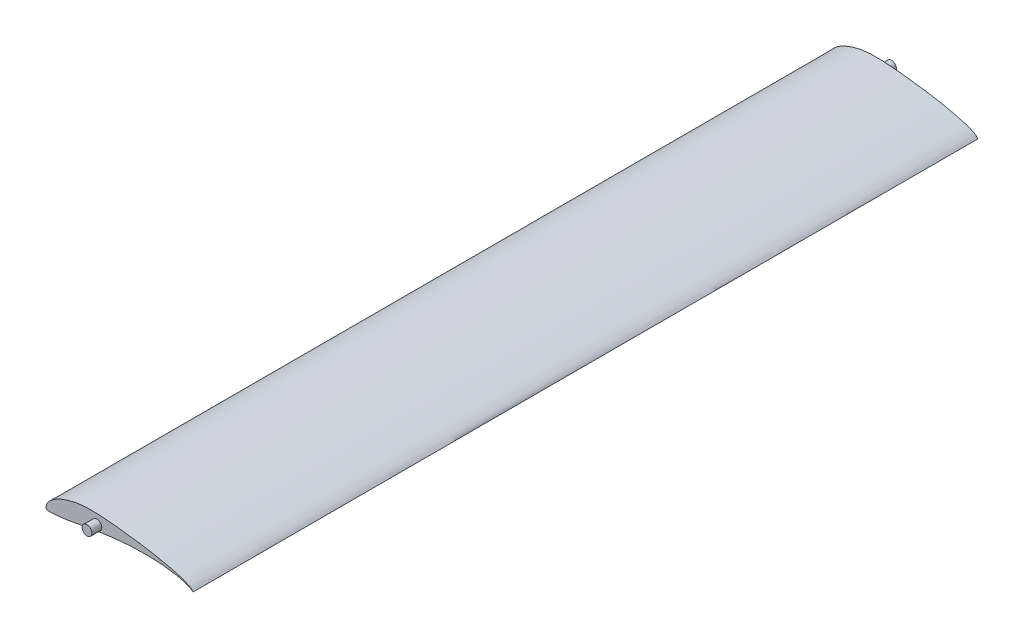
ISO-10303-21;
HEADER;
FILE_DESCRIPTION(('STEP AP214'),'2;1');
FILE_NAME('part.step','',(''),(''),'','','');
FILE_SCHEMA(('AUTOMOTIVE_DESIGN { 1 0 10303 214 1 1 1 1 }'));
ENDSEC;
DATA;
#1=APPLICATION_CONTEXT('core data for automotive mechanical design processes');
#2=APPLICATION_PROTOCOL_DEFINITION('international standard','automotive_design',2000,#1);
#3=PRODUCT_CONTEXT('',#1,'mechanical');
#4=PRODUCT('Part','Part','',(#3));
#5=PRODUCT_RELATED_PRODUCT_CATEGORY('part','',(#4));
#6=PRODUCT_DEFINITION_FORMATION('','',#4);
#7=PRODUCT_DEFINITION_CONTEXT('part definition',#1,'design');
#8=PRODUCT_DEFINITION('design','',#6,#7);
#9=PRODUCT_DEFINITION_SHAPE('','',#8);
#10=(LENGTH_UNIT() NAMED_UNIT(*) SI_UNIT(.MILLI.,.METRE.));
#11=(NAMED_UNIT(*) PLANE_ANGLE_UNIT() SI_UNIT($,.RADIAN.));
#12=(NAMED_UNIT(*) SI_UNIT($,.STERADIAN.) SOLID_ANGLE_UNIT());
#13=UNCERTAINTY_MEASURE_WITH_UNIT(LENGTH_MEASURE(1.E-05),#10,'distance_accuracy_value','');
#14=(GEOMETRIC_REPRESENTATION_CONTEXT(3) GLOBAL_UNCERTAINTY_ASSIGNED_CONTEXT((#13)) GLOBAL_UNIT_ASSIGNED_CONTEXT((#10,
#11,#12)) REPRESENTATION_CONTEXT('',''));
#15=CARTESIAN_POINT('',(0.,0.,0.));
#16=DIRECTION('',(0.,0.,1.));
#17=DIRECTION('',(1.,0.,0.));
#18=AXIS2_PLACEMENT_3D('',#15,#16,#17);
#19=CARTESIAN_POINT('',(75.,0.,200.));
#20=CARTESIAN_POINT('',(75.0004496445761,0.00190909825375727,200.));
#21=CARTESIAN_POINT('',(74.7539650846418,0.18568888920372,200.));
#22=CARTESIAN_POINT('',(74.5455245103844,0.390346100222199,200.));
#23=CARTESIAN_POINT('',(74.0826929591282,0.81782244358845,200.));
#24=CARTESIAN_POINT('',(73.5366428814038,1.272594015395,200.));
#25=CARTESIAN_POINT('',(72.7896369649627,1.73112202127673,200.));
#26=CARTESIAN_POINT('',(71.8606861369259,2.1755580807662,200.));
#27=CARTESIAN_POINT('',(70.7391988465833,2.6394332773395,200.));
#28=CARTESIAN_POINT('',(69.426882591104,3.1162933669167,200.));
#29=CARTESIAN_POINT('',(67.9298593241598,3.60277077102481,200.));
#30=CARTESIAN_POINT('',(66.2559000317893,4.09464350577679,200.));
#31=CARTESIAN_POINT('',(64.4143785726742,4.58960243450024,200.));
#32=CARTESIAN_POINT('',(62.4154624095736,5.08310520978531,200.));
#33=CARTESIAN_POINT('',(60.27061159506,5.5715804249983,200.));
#34=CARTESIAN_POINT('',(57.9926099207445,6.05197727824083,200.));
#35=CARTESIAN_POINT('',(55.5953680809258,6.52182540512935,200.));
#36=CARTESIAN_POINT('',(53.0928958344792,6.97534838004791,200.));
#37=CARTESIAN_POINT('',(50.500952478377,7.41189405377128,200.));
#38=CARTESIAN_POINT('',(47.8344745216971,7.82584741006352,200.));
#39=CARTESIAN_POINT('',(45.1107073437426,8.21800904383186,200.));
#40=CARTESIAN_POINT('',(42.3471068366815,8.58527269117428,200.));
#41=CARTESIAN_POINT('',(39.5636902816788,8.92645928148939,200.));
#42=CARTESIAN_POINT('',(36.7827107486502,9.24397015410012,200.));
#43=CARTESIAN_POINT('',(34.0271887584163,9.52980992301489,200.));
#44=CARTESIAN_POINT('',(31.3195720900264,9.7786387993947,200.));
#45=CARTESIAN_POINT('',(28.6788997026202,9.9764972494583,200.));
#46=CARTESIAN_POINT('',(26.1202528498229,10.1128540004117,200.));
#47=CARTESIAN_POINT('',(23.6578610442693,10.1722065518051,200.));
#48=CARTESIAN_POINT('',(21.3043430859275,10.1667893876018,200.));
#49=CARTESIAN_POINT('',(19.0640739487674,10.0523256556296,200.));
#50=CARTESIAN_POINT('',(16.9361826355282,9.81953966700003,200.));
#51=CARTESIAN_POINT('',(14.912014741791,9.4900378061296,200.));
#52=CARTESIAN_POINT('',(12.9910814536495,9.06292958510876,200.));
#53=CARTESIAN_POINT('',(11.1753642654142,8.56193521707815,200.));
#54=CARTESIAN_POINT('',(9.47254802893839,7.99593650555071,200.));
#55=CARTESIAN_POINT('',(7.889878396715,7.37818056585829,200.));
#56=CARTESIAN_POINT('',(6.43719008088212,6.71197664075074,200.));
#57=CARTESIAN_POINT('',(5.11914570801355,6.01085913549423,200.));
#58=CARTESIAN_POINT('',(3.94291730529894,5.2828038016739,200.));
#59=CARTESIAN_POINT('',(2.91588294840669,4.53767936791485,200.));
#60=CARTESIAN_POINT('',(2.03847172502033,3.79128699549852,200.));
#61=CARTESIAN_POINT('',(1.32340110520667,3.03547157484839,200.));
#62=CARTESIAN_POINT('',(0.774074332682458,2.27677944405746,200.));
#63=CARTESIAN_POINT('',(0.368239292992317,1.53862876914142,200.));
#64=CARTESIAN_POINT('',(0.108063550642199,0.837746589697899,200.));
#65=CARTESIAN_POINT('',(-0.016017959621266,0.190792591828808,200.));
#66=CARTESIAN_POINT('',(0.00770173626844277,-0.356421442258013,200.));
#67=CARTESIAN_POINT('',(0.148409214072156,-0.85834584120313,200.));
#68=CARTESIAN_POINT('',(0.671997952917858,-1.10766100715331,200.));
#69=CARTESIAN_POINT('',(1.37607317791627,-1.14285625358404,200.));
#70=CARTESIAN_POINT('',(2.33925025972924,-1.17706429553805,200.));
#71=CARTESIAN_POINT('',(3.55054606737345,-1.12524848041678,200.));
#72=CARTESIAN_POINT('',(4.99625618674844,-1.0297581612487,200.));
#73=CARTESIAN_POINT('',(6.6602965641612,-0.876579013304086,200.));
#74=CARTESIAN_POINT('',(8.52563879771387,-0.669188084411804,200.));
#75=CARTESIAN_POINT('',(10.583188874696,-0.403118227638063,200.));
#76=CARTESIAN_POINT('',(12.8319576438414,-0.03103015696071,200.));
#77=CARTESIAN_POINT('',(15.2828896232802,0.435689290153553,200.));
#78=CARTESIAN_POINT('',(17.9482186312497,0.943629694509403,200.));
#79=CARTESIAN_POINT('',(20.8149131818034,1.47992386846413,200.));
#80=CARTESIAN_POINT('',(23.8649609021435,2.02227718826716,200.));
#81=CARTESIAN_POINT('',(27.0759564854619,2.55030407495741,200.));
#82=CARTESIAN_POINT('',(30.4229841349676,3.0463439914876,200.));
#83=CARTESIAN_POINT('',(33.8771945164878,3.49216806993824,200.));
#84=CARTESIAN_POINT('',(37.4075217860949,3.87477105665107,200.));
#85=CARTESIAN_POINT('',(40.9806127438822,4.17693355434812,200.));
#86=CARTESIAN_POINT('',(44.5606088702483,4.39076899802771,200.));
#87=CARTESIAN_POINT('',(48.1101062396026,4.50778173767263,200.));
#88=CARTESIAN_POINT('',(51.5905972490682,4.52151734814729,200.));
#89=CARTESIAN_POINT('',(54.9632512783806,4.43097450951274,200.));
#90=CARTESIAN_POINT('',(58.1894498089462,4.23825896008471,200.));
#91=CARTESIAN_POINT('',(61.2303983181482,3.94585627434351,200.));
#92=CARTESIAN_POINT('',(64.0498951493785,3.5649625727911,200.));
#93=CARTESIAN_POINT('',(66.6112334491586,3.10661442607939,200.));
#94=CARTESIAN_POINT('',(68.8843860883419,2.58614328579619,200.));
#95=CARTESIAN_POINT('',(70.8274655002964,2.02938443707066,200.));
#96=CARTESIAN_POINT('',(72.4176279592342,1.43532984662795,200.));
#97=CARTESIAN_POINT('',(73.552126735224,0.891804256587506,200.));
#98=CARTESIAN_POINT('',(74.3885273611334,0.389315433269344,200.));
#99=CARTESIAN_POINT('',(74.7098360264349,0.194861362006685,200.));
#100=CARTESIAN_POINT('',(74.9995412141903,-0.00194791004865642,200.));
#101=CARTESIAN_POINT('',(75.,0.,200.));
#102=B_SPLINE_CURVE_WITH_KNOTS('',3,(#19,#20,#21,#22,#23,#24,#25,#26,#27,#28,#29,#30,#31,#32,
#33,#34,#35,#36,#37,#38,#39,#40,#41,#42,#43,#44,#45,#46,#47,#48,#49,#50,#51,#52,#53,#54,#55,#56,
#57,#58,#59,#60,#61,#62,#63,#64,#65,#66,#67,#68,#69,#70,#71,#72,#73,#74,#75,#76,#77,#78,#79,#80,
#81,#82,#83,#84,#85,#86,#87,#88,#89,#90,#91,#92,#93,#94,#95,#96,#97,#98,#99,#100,#101),
.UNSPECIFIED.,.T.,.F.,(4,1,1,1,1,1,1,1,1,1,1,1,1,1,1,1,1,1,1,1,1,1,1,1,1,1,1,1,1,1,1,1,1,1,1,1,
1,1,1,1,1,1,1,1,1,1,1,1,1,1,1,1,1,1,1,1,1,1,1,1,1,1,1,1,1,1,1,1,1,1,1,1,1,1,1,1,1,1,1,1,4),(0.,
0.000979677557134219,0.00364886216776309,0.00748349851947813,0.0120952771855934,
0.0175255907768788,0.0240517799938711,0.0317830505527587,0.0406778280832619,0.050710300790478,
0.0618332290621795,0.0739892504845854,0.0871181731906813,0.101145048769791,0.115990637111827,
0.131570421640589,0.147788379302961,0.164550916882416,0.181757895150531,0.199311954944345,
0.217095071712265,0.234990228463986,0.252856883122009,0.270540593729572,0.287886779266045,
0.304773437599674,0.321101419214061,0.336806063174811,0.351800032584037,0.366031063392082,
0.379615674919835,0.392652962879186,0.405170358707495,0.417171919049936,0.428603516911185,
0.43941895910826,0.449596586064162,0.459102079103161,0.467907877534646,0.475988300736527,
0.48330896874615,0.489874507816402,0.495803249719208,0.501149411695553,0.505903073256041,
0.510046768536663,0.513579310681042,0.516446926626751,0.519350052590901,0.523823355179486,
0.529973793997694,0.537715654387928,0.546967844488147,0.557637366825711,0.569620481096633,
0.582804124215616,0.597246960791633,0.613135036654701,0.630443600329816,0.649056123608546,
0.668822256795696,0.689594964002685,0.711189650864602,0.733426688964389,0.756094117504156,
0.778988553684861,0.801889682684955,0.824566597829707,0.846792284880412,0.868338290507787,
0.888978162959066,0.908492011340558,0.926658767581933,0.943286193042322,0.958169210358795,
0.971135821634751,0.981955623079976,0.990251791025976,0.995852565249962,0.999000405686701,1.),.UNSPECIFIED.);
#103=DIRECTION('',(0.,0.,-1.));
#104=VECTOR('',#103,1.);
#105=SURFACE_OF_LINEAR_EXTRUSION('',#102,#104);
#106=CARTESIAN_POINT('',(75.,0.,200.));
#107=VERTEX_POINT('',#106);
#108=EDGE_CURVE('E51',#107,#107,#102,.T.);
#109=ORIENTED_EDGE('',*,*,#108,.F.);
#110=EDGE_LOOP('',(#109));
#111=FACE_BOUND('',#110,.T.);
#112=CARTESIAN_POINT('',(75.,0.,-200.));
#113=CARTESIAN_POINT('',(75.0004496445761,0.00190909825375727,-200.));
#114=CARTESIAN_POINT('',(74.7539650846418,0.18568888920372,-200.));
#115=CARTESIAN_POINT('',(74.5455245103844,0.390346100222199,-200.));
#116=CARTESIAN_POINT('',(74.0826929591282,0.81782244358845,-200.));
#117=CARTESIAN_POINT('',(73.5366428814038,1.272594015395,-200.));
#118=CARTESIAN_POINT('',(72.7896369649627,1.73112202127673,-200.));
#119=CARTESIAN_POINT('',(71.8606861369259,2.1755580807662,-200.));
#120=CARTESIAN_POINT('',(70.7391988465833,2.6394332773395,-200.));
#121=CARTESIAN_POINT('',(69.426882591104,3.1162933669167,-200.));
#122=CARTESIAN_POINT('',(67.9298593241598,3.60277077102481,-200.));
#123=CARTESIAN_POINT('',(66.2559000317893,4.09464350577679,-200.));
#124=CARTESIAN_POINT('',(64.4143785726742,4.58960243450024,-200.));
#125=CARTESIAN_POINT('',(62.4154624095736,5.08310520978531,-200.));
#126=CARTESIAN_POINT('',(60.27061159506,5.5715804249983,-200.));
#127=CARTESIAN_POINT('',(57.9926099207445,6.05197727824083,-200.));
#128=CARTESIAN_POINT('',(55.5953680809258,6.52182540512935,-200.));
#129=CARTESIAN_POINT('',(53.0928958344792,6.97534838004791,-200.));
#130=CARTESIAN_POINT('',(50.500952478377,7.41189405377128,-200.));
#131=CARTESIAN_POINT('',(47.8344745216971,7.82584741006352,-200.));
#132=CARTESIAN_POINT('',(45.1107073437426,8.21800904383186,-200.));
#133=CARTESIAN_POINT('',(42.3471068366815,8.58527269117428,-200.));
#134=CARTESIAN_POINT('',(39.5636902816788,8.92645928148939,-200.));
#135=CARTESIAN_POINT('',(36.7827107486502,9.24397015410012,-200.));
#136=CARTESIAN_POINT('',(34.0271887584163,9.52980992301489,-200.));
#137=CARTESIAN_POINT('',(31.3195720900264,9.7786387993947,-200.));
#138=CARTESIAN_POINT('',(28.6788997026202,9.9764972494583,-200.));
#139=CARTESIAN_POINT('',(26.1202528498229,10.1128540004117,-200.));
#140=CARTESIAN_POINT('',(23.6578610442693,10.1722065518051,-200.));
#141=CARTESIAN_POINT('',(21.3043430859275,10.1667893876018,-200.));
#142=CARTESIAN_POINT('',(19.0640739487674,10.0523256556296,-200.));
#143=CARTESIAN_POINT('',(16.9361826355282,9.81953966700003,-200.));
#144=CARTESIAN_POINT('',(14.912014741791,9.4900378061296,-200.));
#145=CARTESIAN_POINT('',(12.9910814536495,9.06292958510876,-200.));
#146=CARTESIAN_POINT('',(11.1753642654142,8.56193521707815,-200.));
#147=CARTESIAN_POINT('',(9.47254802893839,7.99593650555071,-200.));
#148=CARTESIAN_POINT('',(7.889878396715,7.37818056585829,-200.));
#149=CARTESIAN_POINT('',(6.43719008088212,6.71197664075074,-200.));
#150=CARTESIAN_POINT('',(5.11914570801355,6.01085913549423,-200.));
#151=CARTESIAN_POINT('',(3.94291730529894,5.2828038016739,-200.));
#152=CARTESIAN_POINT('',(2.91588294840669,4.53767936791485,-200.));
#153=CARTESIAN_POINT('',(2.03847172502033,3.79128699549852,-200.));
#154=CARTESIAN_POINT('',(1.32340110520667,3.03547157484839,-200.));
#155=CARTESIAN_POINT('',(0.774074332682458,2.27677944405746,-200.));
#156=CARTESIAN_POINT('',(0.368239292992317,1.53862876914142,-200.));
#157=CARTESIAN_POINT('',(0.108063550642199,0.837746589697899,-200.));
#158=CARTESIAN_POINT('',(-0.016017959621266,0.190792591828808,-200.));
#159=CARTESIAN_POINT('',(0.00770173626844277,-0.356421442258013,-200.));
#160=CARTESIAN_POINT('',(0.148409214072156,-0.85834584120313,-200.));
#161=CARTESIAN_POINT('',(0.671997952917858,-1.10766100715331,-200.));
#162=CARTESIAN_POINT('',(1.37607317791627,-1.14285625358404,-200.));
#163=CARTESIAN_POINT('',(2.33925025972924,-1.17706429553805,-200.));
#164=CARTESIAN_POINT('',(3.55054606737345,-1.12524848041678,-200.));
#165=CARTESIAN_POINT('',(4.99625618674844,-1.0297581612487,-200.));
#166=CARTESIAN_POINT('',(6.6602965641612,-0.876579013304086,-200.));
#167=CARTESIAN_POINT('',(8.52563879771387,-0.669188084411804,-200.));
#168=CARTESIAN_POINT('',(10.583188874696,-0.403118227638063,-200.));
#169=CARTESIAN_POINT('',(12.8319576438414,-0.03103015696071,-200.));
#170=CARTESIAN_POINT('',(15.2828896232802,0.435689290153553,-200.));
#171=CARTESIAN_POINT('',(17.9482186312497,0.943629694509403,-200.));
#172=CARTESIAN_POINT('',(20.8149131818034,1.47992386846413,-200.));
#173=CARTESIAN_POINT('',(23.8649609021435,2.02227718826716,-200.));
#174=CARTESIAN_POINT('',(27.0759564854619,2.55030407495741,-200.));
#175=CARTESIAN_POINT('',(30.4229841349676,3.0463439914876,-200.));
#176=CARTESIAN_POINT('',(33.8771945164878,3.49216806993824,-200.));
#177=CARTESIAN_POINT('',(37.4075217860949,3.87477105665107,-200.));
#178=CARTESIAN_POINT('',(40.9806127438822,4.17693355434812,-200.));
#179=CARTESIAN_POINT('',(44.5606088702483,4.39076899802771,-200.));
#180=CARTESIAN_POINT('',(48.1101062396026,4.50778173767263,-200.));
#181=CARTESIAN_POINT('',(51.5905972490682,4.52151734814729,-200.));
#182=CARTESIAN_POINT('',(54.9632512783806,4.43097450951274,-200.));
#183=CARTESIAN_POINT('',(58.1894498089462,4.23825896008471,-200.));
#184=CARTESIAN_POINT('',(61.2303983181482,3.94585627434351,-200.));
#185=CARTESIAN_POINT('',(64.0498951493785,3.5649625727911,-200.));
#186=CARTESIAN_POINT('',(66.6112334491586,3.10661442607939,-200.));
#187=CARTESIAN_POINT('',(68.8843860883419,2.58614328579619,-200.));
#188=CARTESIAN_POINT('',(70.8274655002964,2.02938443707066,-200.));
#189=CARTESIAN_POINT('',(72.4176279592342,1.43532984662795,-200.));
#190=CARTESIAN_POINT('',(73.552126735224,0.891804256587506,-200.));
#191=CARTESIAN_POINT('',(74.3885273611334,0.389315433269344,-200.));
#192=CARTESIAN_POINT('',(74.7098360264349,0.194861362006685,-200.));
#193=CARTESIAN_POINT('',(74.9995412141903,-0.00194791004865642,-200.));
#194=CARTESIAN_POINT('',(75.,0.,-200.));
#195=B_SPLINE_CURVE_WITH_KNOTS('',3,(#112,#113,#114,#115,#116,#117,#118,#119,#120,#121,#122,
#123,#124,#125,#126,#127,#128,#129,#130,#131,#132,#133,#134,#135,#136,#137,#138,#139,#140,#141,
#142,#143,#144,#145,#146,#147,#148,#149,#150,#151,#152,#153,#154,#155,#156,#157,#158,#159,#160,
#161,#162,#163,#164,#165,#166,#167,#168,#169,#170,#171,#172,#173,#174,#175,#176,#177,#178,#179,
#180,#181,#182,#183,#184,#185,#186,#187,#188,#189,#190,#191,#192,#193,#194),.UNSPECIFIED.,.T.,
.F.,(4,1,1,1,1,1,1,1,1,1,1,1,1,1,1,1,1,1,1,1,1,1,1,1,1,1,1,1,1,1,1,1,1,1,1,1,1,1,1,1,1,1,1,1,1,
1,1,1,1,1,1,1,1,1,1,1,1,1,1,1,1,1,1,1,1,1,1,1,1,1,1,1,1,1,1,1,1,1,1,1,4),(0.,
0.000979677557134219,0.00364886216776309,0.00748349851947813,0.0120952771855934,
0.0175255907768788,0.0240517799938711,0.0317830505527587,0.0406778280832619,0.050710300790478,
0.0618332290621795,0.0739892504845854,0.0871181731906813,0.101145048769791,0.115990637111827,
0.131570421640589,0.147788379302961,0.164550916882416,0.181757895150531,0.199311954944345,
0.217095071712265,0.234990228463986,0.252856883122009,0.270540593729572,0.287886779266045,
0.304773437599674,0.321101419214061,0.336806063174811,0.351800032584037,0.366031063392082,
0.379615674919835,0.392652962879186,0.405170358707495,0.417171919049936,0.428603516911185,
0.43941895910826,0.449596586064162,0.459102079103161,0.467907877534646,0.475988300736527,
0.48330896874615,0.489874507816402,0.495803249719208,0.501149411695553,0.505903073256041,
0.510046768536663,0.513579310681042,0.516446926626751,0.519350052590901,0.523823355179486,
0.529973793997694,0.537715654387928,0.546967844488147,0.557637366825711,0.569620481096633,
0.582804124215616,0.597246960791633,0.613135036654701,0.630443600329816,0.649056123608546,
0.668822256795696,0.689594964002685,0.711189650864602,0.733426688964389,0.756094117504156,
0.778988553684861,0.801889682684955,0.824566597829707,0.846792284880412,0.868338290507787,
0.888978162959066,0.908492011340558,0.926658767581933,0.943286193042322,0.958169210358795,
0.971135821634751,0.981955623079976,0.990251791025976,0.995852565249962,0.999000405686701,1.),.UNSPECIFIED.);
#196=CARTESIAN_POINT('',(75.,0.,-200.));
#197=VERTEX_POINT('',#196);
#198=EDGE_CURVE('E56',#197,#197,#195,.T.);
#199=ORIENTED_EDGE('',*,*,#198,.T.);
#200=EDGE_LOOP('',(#199));
#201=FACE_BOUND('',#200,.T.);
#202=ADVANCED_FACE('F43',(#111,#201),#105,.F.);
#203=CARTESIAN_POINT('',(0.450338300935296,1.66573395352046,200.));
#204=DIRECTION('',(0.,0.,-1.));
#205=DIRECTION('',(-1.,0.,0.));
#206=AXIS2_PLACEMENT_3D('',#203,#204,#205);
#207=PLANE('',#206);
#208=CARTESIAN_POINT('',(25.9227057374902,5.14991333047376,200.));
#209=DIRECTION('',(0.,0.,-1.));
#210=DIRECTION('',(-1.,0.,0.));
#211=AXIS2_PLACEMENT_3D('',#208,#209,#210);
#212=CIRCLE('',#211,2.5);
#213=CARTESIAN_POINT('',(23.4227057374902,5.14991333047376,200.));
#214=VERTEX_POINT('',#213);
#215=EDGE_CURVE('E11',#214,#214,#212,.F.);
#216=ORIENTED_EDGE('',*,*,#215,.F.);
#217=EDGE_LOOP('',(#216));
#218=FACE_BOUND('',#217,.T.);
#219=ORIENTED_EDGE('',*,*,#108,.T.);
#220=EDGE_LOOP('',(#219));
#221=FACE_BOUND('',#220,.T.);
#222=ADVANCED_FACE('F106',(#218,#221),#207,.F.);
#223=CARTESIAN_POINT('',(0.450338300935296,1.66573395352046,-200.));
#224=DIRECTION('',(0.,0.,-1.));
#225=DIRECTION('',(-1.,0.,0.));
#226=AXIS2_PLACEMENT_3D('',#223,#224,#225);
#227=PLANE('',#226);
#228=CARTESIAN_POINT('',(25.9227057374902,5.14991333047376,-200.));
#229=DIRECTION('',(0.,0.,-1.));
#230=DIRECTION('',(-1.,0.,0.));
#231=AXIS2_PLACEMENT_3D('',#228,#229,#230);
#232=CIRCLE('',#231,2.5);
#233=CARTESIAN_POINT('',(23.4227057374902,5.14991333047376,-200.));
#234=VERTEX_POINT('',#233);
#235=EDGE_CURVE('E81',#234,#234,#232,.F.);
#236=ORIENTED_EDGE('',*,*,#235,.T.);
#237=EDGE_LOOP('',(#236));
#238=FACE_BOUND('',#237,.T.);
#239=ORIENTED_EDGE('',*,*,#198,.F.);
#240=EDGE_LOOP('',(#239));
#241=FACE_BOUND('',#240,.T.);
#242=ADVANCED_FACE('F86',(#238,#241),#227,.T.);
#243=CARTESIAN_POINT('',(25.9227057374902,5.14991333047376,217.071067811865));
#244=DIRECTION('',(0.,0.,-1.));
#245=DIRECTION('',(-1.,0.,0.));
#246=AXIS2_PLACEMENT_3D('',#243,#244,#245);
#247=CYLINDRICAL_SURFACE('',#246,2.5);
#248=CARTESIAN_POINT('',(25.9227057374902,5.14991333047376,205.));
#249=DIRECTION('',(0.,0.,-1.));
#250=DIRECTION('',(-1.,0.,0.));
#251=AXIS2_PLACEMENT_3D('',#248,#249,#250);
#252=CIRCLE('',#251,2.5);
#253=CARTESIAN_POINT('',(23.4227057374902,5.14991333047376,205.));
#254=VERTEX_POINT('',#253);
#255=EDGE_CURVE('E61',#254,#254,#252,.T.);
#256=ORIENTED_EDGE('',*,*,#255,.T.);
#257=EDGE_LOOP('',(#256));
#258=FACE_BOUND('',#257,.T.);
#259=ORIENTED_EDGE('',*,*,#215,.T.);
#260=EDGE_LOOP('',(#259));
#261=FACE_BOUND('',#260,.T.);
#262=ADVANCED_FACE('F101',(#258,#261),#247,.T.);
#263=CARTESIAN_POINT('',(0.450338300935296,1.66573395352046,205.));
#264=DIRECTION('',(0.,0.,-1.));
#265=DIRECTION('',(-1.,0.,0.));
#266=AXIS2_PLACEMENT_3D('',#263,#264,#265);
#267=PLANE('',#266);
#268=ORIENTED_EDGE('',*,*,#255,.F.);
#269=EDGE_LOOP('',(#268));
#270=FACE_BOUND('',#269,.T.);
#271=ADVANCED_FACE('F92',(#270),#267,.F.);
#272=CARTESIAN_POINT('',(25.9227057374902,5.14991333047376,-217.071067811865));
#273=DIRECTION('',(0.,0.,1.));
#274=DIRECTION('',(-1.,0.,0.));
#275=AXIS2_PLACEMENT_3D('',#272,#273,#274);
#276=CYLINDRICAL_SURFACE('',#275,2.5);
#277=CARTESIAN_POINT('',(25.9227057374902,5.14991333047376,-205.));
#278=DIRECTION('',(0.,0.,-1.));
#279=DIRECTION('',(-1.,0.,0.));
#280=AXIS2_PLACEMENT_3D('',#277,#278,#279);
#281=CIRCLE('',#280,2.5);
#282=CARTESIAN_POINT('',(23.4227057374902,5.14991333047376,-205.));
#283=VERTEX_POINT('',#282);
#284=EDGE_CURVE('E77',#283,#283,#281,.T.);
#285=ORIENTED_EDGE('',*,*,#284,.F.);
#286=EDGE_LOOP('',(#285));
#287=FACE_BOUND('',#286,.T.);
#288=ORIENTED_EDGE('',*,*,#235,.F.);
#289=EDGE_LOOP('',(#288));
#290=FACE_BOUND('',#289,.T.);
#291=ADVANCED_FACE('F89',(#287,#290),#276,.T.);
#292=CARTESIAN_POINT('',(0.450338300935296,1.66573395352046,-205.));
#293=DIRECTION('',(0.,0.,1.));
#294=DIRECTION('',(-1.,0.,0.));
#295=AXIS2_PLACEMENT_3D('',#292,#293,#294);
#296=PLANE('',#295);
#297=ORIENTED_EDGE('',*,*,#284,.T.);
#298=EDGE_LOOP('',(#297));
#299=FACE_BOUND('',#298,.T.);
#300=ADVANCED_FACE('F91',(#299),#296,.F.);
#301=CLOSED_SHELL('',(#202,#222,#242,#262,#271,#291,#300));
#302=MANIFOLD_SOLID_BREP('B2',#301);
#303=ADVANCED_BREP_SHAPE_REPRESENTATION('',(#18,#302),#14);
#304=SHAPE_DEFINITION_REPRESENTATION(#9,#303);
ENDSEC;
END-ISO-10303-21;
